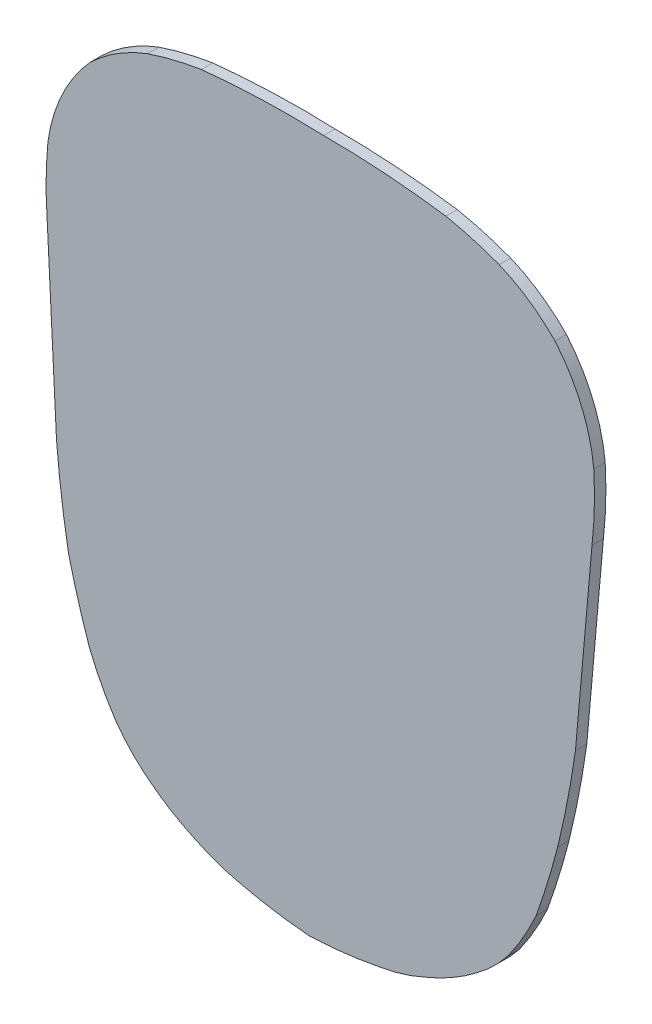
ISO-10303-21;
HEADER;
FILE_DESCRIPTION(('STEP AP214'),'2;1');
FILE_NAME('part.step','',(''),(''),'','','');
FILE_SCHEMA(('AUTOMOTIVE_DESIGN { 1 0 10303 214 1 1 1 1 }'));
ENDSEC;
DATA;
#1=APPLICATION_CONTEXT('core data for automotive mechanical design processes');
#2=APPLICATION_PROTOCOL_DEFINITION('international standard','automotive_design',2000,#1);
#3=PRODUCT_CONTEXT('',#1,'mechanical');
#4=PRODUCT('Part','Part','',(#3));
#5=PRODUCT_RELATED_PRODUCT_CATEGORY('part','',(#4));
#6=PRODUCT_DEFINITION_FORMATION('','',#4);
#7=PRODUCT_DEFINITION_CONTEXT('part definition',#1,'design');
#8=PRODUCT_DEFINITION('design','',#6,#7);
#9=PRODUCT_DEFINITION_SHAPE('','',#8);
#10=(LENGTH_UNIT() NAMED_UNIT(*) SI_UNIT(.MILLI.,.METRE.));
#11=(NAMED_UNIT(*) PLANE_ANGLE_UNIT() SI_UNIT($,.RADIAN.));
#12=(NAMED_UNIT(*) SI_UNIT($,.STERADIAN.) SOLID_ANGLE_UNIT());
#13=UNCERTAINTY_MEASURE_WITH_UNIT(LENGTH_MEASURE(1.E-05),#10,'distance_accuracy_value','');
#14=(GEOMETRIC_REPRESENTATION_CONTEXT(3) GLOBAL_UNCERTAINTY_ASSIGNED_CONTEXT((#13)) GLOBAL_UNIT_ASSIGNED_CONTEXT((#10,
#11,#12)) REPRESENTATION_CONTEXT('',''));
#15=CARTESIAN_POINT('',(0.,0.,0.));
#16=DIRECTION('',(0.,0.,1.));
#17=DIRECTION('',(1.,0.,0.));
#18=AXIS2_PLACEMENT_3D('',#15,#16,#17);
#19=CARTESIAN_POINT('',(-2.87645068487024,-22.2307778413904,40.6500965279302));
#20=DIRECTION('',(0.,0.,1.));
#21=DIRECTION('',(0.0193548335692301,0.999812677663925,0.));
#22=AXIS2_PLACEMENT_3D('',#19,#20,#21);
#23=PLANE('',#22);
#24=CARTESIAN_POINT('',(3.40605421210535,8.02001484887186,40.65009652793));
#25=DIRECTION('',(0.,0.,-1.));
#26=DIRECTION('',(-0.0193548335692301,-0.999812677663925,0.));
#27=AXIS2_PLACEMENT_3D('',#24,#25,#26);
#28=CIRCLE('',#27,7.43643173112);
#29=CARTESIAN_POINT('',(8.74976189327235,13.1916011731872,40.6500965279301));
#30=VERTEX_POINT('',#29);
#31=CARTESIAN_POINT('',(6.29473617833661,14.8724621043842,40.6500965279299));
#32=VERTEX_POINT('',#31);
#33=EDGE_CURVE('E362',#30,#32,#28,.F.);
#34=ORIENTED_EDGE('',*,*,#33,.F.);
#35=CARTESIAN_POINT('',(3.11803650286184,8.4313045354857,40.6500965279299));
#36=DIRECTION('',(0.,0.,-1.));
#37=DIRECTION('',(-0.0193548335692301,-0.999812677663925,0.));
#38=AXIS2_PLACEMENT_3D('',#35,#36,#37);
#39=CIRCLE('',#38,7.3740595978);
#40=CARTESIAN_POINT('',(10.4553019723893,9.16702892789537,40.6500965279302));
#41=VERTEX_POINT('',#40);
#42=EDGE_CURVE('E208',#41,#30,#39,.F.);
#43=ORIENTED_EDGE('',*,*,#42,.F.);
#44=CARTESIAN_POINT('',(-6.32552371849103,8.14421174061839,40.6500965279296));
#45=DIRECTION('',(0.,0.,-1.));
#46=DIRECTION('',(-0.0193548335692301,-0.999812677663925,0.));
#47=AXIS2_PLACEMENT_3D('',#44,#45,#46);
#48=CIRCLE('',#47,16.81196793556);
#49=CARTESIAN_POINT('',(10.3766044314372,6.22557130278915,40.6500965279302));
#50=VERTEX_POINT('',#49);
#51=EDGE_CURVE('E35',#50,#41,#48,.F.);
#52=ORIENTED_EDGE('',*,*,#51,.F.);
#53=DIRECTION('',(-0.0886995040357044,-0.996058431008854,0.));
#54=VECTOR('',#53,1.);
#55=CARTESIAN_POINT('',(10.3766044314372,6.22557130278917,40.6500965279302));
#56=LINE('',#55,#54);
#57=CARTESIAN_POINT('',(9.64811099468473,-1.9551061147509,40.6500965279303));
#58=VERTEX_POINT('',#57);
#59=EDGE_CURVE('E207',#50,#58,#56,.T.);
#60=ORIENTED_EDGE('',*,*,#59,.T.);
#61=CARTESIAN_POINT('',(-31.2814474166912,3.8013435473197,40.6500965279289));
#62=DIRECTION('',(0.,0.,-1.));
#63=DIRECTION('',(-0.0193548335692301,-0.999812677663925,0.));
#64=AXIS2_PLACEMENT_3D('',#61,#62,#63);
#65=CIRCLE('',#64,41.33237791928);
#66=CARTESIAN_POINT('',(8.86403234955439,-6.03257321052164,40.6500965279303));
#67=VERTEX_POINT('',#66);
#68=EDGE_CURVE('E218',#67,#58,#65,.F.);
#69=ORIENTED_EDGE('',*,*,#68,.F.);
#70=CARTESIAN_POINT('',(-24.9737606237931,2.68335405814092,40.6500965279291));
#71=DIRECTION('',(0.,0.,-1.));
#72=DIRECTION('',(-0.0193548335692301,-0.999812677663925,0.));
#73=AXIS2_PLACEMENT_3D('',#70,#71,#72);
#74=CIRCLE('',#73,34.94228987144);
#75=CARTESIAN_POINT('',(7.91947678147978,-9.10641075970414,40.6500965279303));
#76=VERTEX_POINT('',#75);
#77=EDGE_CURVE('E302',#76,#67,#74,.F.);
#78=ORIENTED_EDGE('',*,*,#77,.F.);
#79=CARTESIAN_POINT('',(-3.58067037627307,-3.93497982202901,40.6500965279299));
#80=DIRECTION('',(0.,0.,-1.));
#81=DIRECTION('',(-0.0193548335692301,-0.999812677663925,0.));
#82=AXIS2_PLACEMENT_3D('',#79,#80,#81);
#83=CIRCLE('',#82,12.60940452968);
#84=CARTESIAN_POINT('',(6.69776683055141,-11.2391437836663,40.6500965279303));
#85=VERTEX_POINT('',#84);
#86=EDGE_CURVE('E305',#85,#76,#83,.F.);
#87=ORIENTED_EDGE('',*,*,#86,.F.);
#88=CARTESIAN_POINT('',(1.10266886694135,-6.86934474010805,40.6500965279301));
#89=DIRECTION('',(0.,0.,-1.));
#90=DIRECTION('',(-0.0193548335692301,-0.999812677663925,0.));
#91=AXIS2_PLACEMENT_3D('',#88,#89,#90);
#92=CIRCLE('',#91,7.09931439672);
#93=CARTESIAN_POINT('',(5.30083998115858,-12.5943446701716,40.6500965279303));
#94=VERTEX_POINT('',#93);
#95=EDGE_CURVE('E308',#94,#85,#92,.F.);
#96=ORIENTED_EDGE('',*,*,#95,.F.);
#97=CARTESIAN_POINT('',(-0.638723059391889,-4.83953730632285,40.65009652793));
#98=DIRECTION('',(0.,0.,-1.));
#99=DIRECTION('',(-0.0193548335692301,-0.999812677663925,0.));
#100=AXIS2_PLACEMENT_3D('',#97,#98,#99);
#101=CIRCLE('',#100,9.76808304444);
#102=CARTESIAN_POINT('',(3.02325465351674,-13.8952187049387,40.6500965279303));
#103=VERTEX_POINT('',#102);
#104=EDGE_CURVE('E311',#103,#94,#101,.F.);
#105=ORIENTED_EDGE('',*,*,#104,.F.);
#106=CARTESIAN_POINT('',(-0.207770559998184,-6.83732878190935,40.6500965279301));
#107=DIRECTION('',(0.,0.,-1.));
#108=DIRECTION('',(-0.0193548335692301,-0.999812677663925,0.));
#109=AXIS2_PLACEMENT_3D('',#106,#107,#108);
#110=CIRCLE('',#109,7.76230211316);
#111=CARTESIAN_POINT('',(1.11765382111102,-14.4856347581324,40.6500965279302));
#112=VERTEX_POINT('',#111);
#113=EDGE_CURVE('E314',#112,#103,#110,.F.);
#114=ORIENTED_EDGE('',*,*,#113,.F.);
#115=CARTESIAN_POINT('',(-2.80966912930594,4.7550090968341,40.6500965279298));
#116=DIRECTION('',(0.,0.,-1.));
#117=DIRECTION('',(-0.0193548335692301,-0.999812677663925,0.));
#118=AXIS2_PLACEMENT_3D('',#115,#116,#117);
#119=CIRCLE('',#118,19.6373684976);
#120=CARTESIAN_POINT('',(-2.01526832310912,-14.8662846645275,40.6500965279301));
#121=VERTEX_POINT('',#120);
#122=EDGE_CURVE('E317',#121,#112,#119,.F.);
#123=ORIENTED_EDGE('',*,*,#122,.F.);
#124=CARTESIAN_POINT('',(-0.523207579480618,4.71400533480678,40.6500965279299));
#125=DIRECTION('',(0.,0.,-1.));
#126=DIRECTION('',(-0.0193548335692301,-0.999812677663925,0.));
#127=AXIS2_PLACEMENT_3D('',#124,#125,#126);
#128=CIRCLE('',#127,19.63705684976);
#129=CARTESIAN_POINT('',(-5.1763378218956,-14.3637927736708,40.65009652793));
#130=VERTEX_POINT('',#129);
#131=EDGE_CURVE('E320',#130,#121,#128,.F.);
#132=ORIENTED_EDGE('',*,*,#131,.F.);
#133=CARTESIAN_POINT('',(-3.55589855490557,-6.7725141805769,40.6500965279299));
#134=DIRECTION('',(0.,0.,-1.));
#135=DIRECTION('',(-0.0193548335692301,-0.999812677663925,0.));
#136=AXIS2_PLACEMENT_3D('',#133,#134,#135);
#137=CIRCLE('',#136,7.76230211316);
#138=CARTESIAN_POINT('',(-7.05766041396085,-13.7000677154429,40.6500965279299));
#139=VERTEX_POINT('',#138);
#140=EDGE_CURVE('E323',#139,#130,#137,.F.);
#141=ORIENTED_EDGE('',*,*,#140,.F.);
#142=CARTESIAN_POINT('',(-3.04794957670775,-4.79289839153915,40.6500965279299));
#143=DIRECTION('',(0.,0.,-1.));
#144=DIRECTION('',(-0.0193548335692301,-0.999812677663925,0.));
#145=AXIS2_PLACEMENT_3D('',#142,#143,#144);
#146=CIRCLE('',#145,9.76808304444);
#147=CARTESIAN_POINT('',(-9.28319236302833,-12.3120202657152,40.6500965279298));
#148=VERTEX_POINT('',#147);
#149=EDGE_CURVE('E326',#148,#139,#146,.F.);
#150=ORIENTED_EDGE('',*,*,#149,.F.);
#151=CARTESIAN_POINT('',(-4.76167465689594,-6.8387997753086,40.6500965279299));
#152=DIRECTION('',(0.,0.,-1.));
#153=DIRECTION('',(-0.0193548335692301,-0.999812677663925,0.));
#154=AXIS2_PLACEMENT_3D('',#151,#152,#153);
#155=CIRCLE('',#154,7.09931439672);
#156=CARTESIAN_POINT('',(-10.5813963887554,-10.9046457963967,40.6500965279298));
#157=VERTEX_POINT('',#156);
#158=EDGE_CURVE('E329',#157,#148,#155,.F.);
#159=ORIENTED_EDGE('',*,*,#158,.F.);
#160=CARTESIAN_POINT('',(-0.0279711922389195,-4.00375460651083,40.65009652793));
#161=DIRECTION('',(0.,0.,-1.));
#162=DIRECTION('',(-0.0193548335692301,-0.999812677663925,0.));
#163=AXIS2_PLACEMENT_3D('',#160,#161,#162);
#164=CIRCLE('',#163,12.60940452968);
#165=CARTESIAN_POINT('',(-11.719649090564,-8.72622753019504,40.6500965279297));
#166=VERTEX_POINT('',#165);
#167=EDGE_CURVE('E332',#166,#157,#164,.F.);
#168=ORIENTED_EDGE('',*,*,#167,.F.);
#169=CARTESIAN_POINT('',(21.3074102324666,2.68328490166432,40.6500965279306));
#170=DIRECTION('',(0.,0.,-1.));
#171=DIRECTION('',(-0.0193548335692301,-0.999812677663925,0.));
#172=AXIS2_PLACEMENT_3D('',#169,#170,#171);
#173=CIRCLE('',#172,34.94228987144);
#174=CARTESIAN_POINT('',(-12.6348799299237,-5.61638738053111,40.6500965279296));
#175=VERTEX_POINT('',#174);
#176=EDGE_CURVE('E335',#175,#166,#173,.F.);
#177=ORIENTED_EDGE('',*,*,#176,.F.);
#178=CARTESIAN_POINT('',(28.0310735031443,1.77588533100576,40.6500965279308));
#179=DIRECTION('',(0.,0.,-1.));
#180=DIRECTION('',(-0.0193548335692301,-0.999812677663925,0.));
#181=AXIS2_PLACEMENT_3D('',#178,#179,#180);
#182=CIRCLE('',#181,41.33237791928);
#183=CARTESIAN_POINT('',(-13.1702154109103,-1.51337845938617,40.6500965279295));
#184=VERTEX_POINT('',#183);
#185=EDGE_CURVE('E338',#184,#175,#182,.F.);
#186=ORIENTED_EDGE('',*,*,#185,.F.);
#187=DIRECTION('',(-0.0500831809567766,0.998745050042928,0.));
#188=VECTOR('',#187,1.);
#189=CARTESIAN_POINT('',(-13.1702154109104,-1.51337845938577,40.6500965279295));
#190=LINE('',#189,#188);
#191=CARTESIAN_POINT('',(-13.581551066226,6.6893642938588,40.6500965279294));
#192=VERTEX_POINT('',#191);
#193=EDGE_CURVE('E226',#184,#192,#190,.T.);
#194=ORIENTED_EDGE('',*,*,#193,.T.);
#195=CARTESIAN_POINT('',(3.18231954948573,7.96015453853931,40.6500965279299));
#196=DIRECTION('',(0.,0.,-1.));
#197=DIRECTION('',(-0.0193548335692301,-0.999812677663925,0.));
#198=AXIS2_PLACEMENT_3D('',#195,#196,#197);
#199=CIRCLE('',#198,16.81196793556);
#200=CARTESIAN_POINT('',(-13.5463481289566,9.63166390750373,40.6500965279294));
#201=VERTEX_POINT('',#200);
#202=EDGE_CURVE('E229',#201,#192,#199,.F.);
#203=ORIENTED_EDGE('',*,*,#202,.F.);
#204=CARTESIAN_POINT('',(-6.24305419079949,8.61252083374831,40.6500965279296));
#205=DIRECTION('',(0.,0.,-1.));
#206=DIRECTION('',(-0.0193548335692301,-0.999812677663925,0.));
#207=AXIS2_PLACEMENT_3D('',#204,#205,#206);
#208=CIRCLE('',#207,7.3740595978);
#209=CARTESIAN_POINT('',(-11.6863252040827,13.5872123445716,40.6500965279294));
#210=VERTEX_POINT('',#209);
#211=EDGE_CURVE('E344',#210,#201,#208,.F.);
#212=ORIENTED_EDGE('',*,*,#211,.F.);
#213=CARTESIAN_POINT('',(-6.54677401618397,8.21268627443506,40.6500965279296));
#214=DIRECTION('',(0.,0.,-1.));
#215=DIRECTION('',(-0.0193548335692301,-0.999812677663925,0.));
#216=AXIS2_PLACEMENT_3D('',#213,#214,#215);
#217=CIRCLE('',#216,7.43643173112);
#218=CARTESIAN_POINT('',(-9.16808546254466,15.17179851615,40.6500965279295));
#219=VERTEX_POINT('',#218);
#220=EDGE_CURVE('E347',#219,#210,#217,.F.);
#221=ORIENTED_EDGE('',*,*,#220,.F.);
#222=CARTESIAN_POINT('',(-4.43670572158516,1.02428534892834,40.6500965279298));
#223=DIRECTION('',(0.,0.,-1.));
#224=DIRECTION('',(-0.0193548335692301,-0.999812677663925,0.));
#225=AXIS2_PLACEMENT_3D('',#222,#223,#224);
#226=CIRCLE('',#225,14.91771038296);
#227=CARTESIAN_POINT('',(-6.80003650135277,15.7536013783737,40.6500965279295));
#228=VERTEX_POINT('',#227);
#229=EDGE_CURVE('E350',#228,#219,#226,.F.);
#230=ORIENTED_EDGE('',*,*,#229,.F.);
#231=CARTESIAN_POINT('',(-2.87645068487024,-22.2307778413904,40.6500965279302));
#232=DIRECTION('',(0.,0.,-1.));
#233=DIRECTION('',(-0.0193548335692301,-0.999812677663925,0.));
#234=AXIS2_PLACEMENT_3D('',#231,#232,#233);
#235=CIRCLE('',#234,38.18648439396);
#236=CARTESIAN_POINT('',(-1.41914055333817,15.9278887698879,40.6500965279297));
#237=VERTEX_POINT('',#236);
#238=EDGE_CURVE('E353',#237,#228,#235,.F.);
#239=ORIENTED_EDGE('',*,*,#238,.F.);
#240=CARTESIAN_POINT('',(-1.43975485684213,-22.2585901013477,40.6500965279302));
#241=DIRECTION('',(0.,0.,-1.));
#242=DIRECTION('',(-0.0193548335692301,-0.999812677663925,0.));
#243=AXIS2_PLACEMENT_3D('',#240,#241,#242);
#244=CIRCLE('',#243,38.186484435371);
#245=CARTESIAN_POINT('',(3.95097858118653,15.5454782846468,40.6500965279299));
#246=VERTEX_POINT('',#245);
#247=EDGE_CURVE('E356',#246,#237,#244,.F.);
#248=ORIENTED_EDGE('',*,*,#247,.F.);
#249=CARTESIAN_POINT('',(1.01935833845508,0.91866435193131,40.65009652793));
#250=DIRECTION('',(0.,0.,-1.));
#251=DIRECTION('',(-0.0193548335692301,-0.999812677663925,0.));
#252=AXIS2_PLACEMENT_3D('',#249,#250,#251);
#253=CIRCLE('',#252,14.91771038296);
#254=EDGE_CURVE('E359',#32,#246,#253,.F.);
#255=ORIENTED_EDGE('',*,*,#254,.F.);
#256=EDGE_LOOP('',(#34,#43,#52,#60,#69,#78,#87,#96,#105,#114,#123,#132,#141,#150,#159,#168,#177,
#186,#194,#203,#212,#221,#230,#239,#248,#255));
#257=FACE_BOUND('',#256,.T.);
#258=ADVANCED_FACE('F32',(#257),#23,.F.);
#259=CARTESIAN_POINT('',(-6.32552371849104,8.1442117406184,41.0310965279296));
#260=DIRECTION('',(0.,0.,-1.));
#261=DIRECTION('',(-0.0193548335692301,-0.999812677663925,0.));
#262=AXIS2_PLACEMENT_3D('',#259,#260,#261);
#263=CYLINDRICAL_SURFACE('',#262,16.81196793556);
#264=DIRECTION('',(0.,0.,-1.));
#265=VECTOR('',#264,1.);
#266=CARTESIAN_POINT('',(10.4553019723893,9.16702892789542,41.0310965279302));
#267=LINE('',#266,#265);
#268=CARTESIAN_POINT('',(10.4553019723893,9.1670289278954,41.1510965279302));
#269=VERTEX_POINT('',#268);
#270=EDGE_CURVE('E211',#269,#41,#267,.T.);
#271=ORIENTED_EDGE('',*,*,#270,.F.);
#272=CARTESIAN_POINT('',(-6.32552371849105,8.1442117406184,41.1510965279296));
#273=DIRECTION('',(0.,0.,-1.));
#274=DIRECTION('',(-0.0193548335692301,-0.999812677663925,0.));
#275=AXIS2_PLACEMENT_3D('',#272,#273,#274);
#276=CIRCLE('',#275,16.81196793556);
#277=CARTESIAN_POINT('',(10.3766044314372,6.22557130278928,41.1510965279302));
#278=VERTEX_POINT('',#277);
#279=EDGE_CURVE('E216',#278,#269,#276,.F.);
#280=ORIENTED_EDGE('',*,*,#279,.F.);
#281=DIRECTION('',(0.,0.,1.));
#282=VECTOR('',#281,1.);
#283=CARTESIAN_POINT('',(10.3766044314372,6.22557130278919,41.0310965279302));
#284=LINE('',#283,#282);
#285=EDGE_CURVE('E213',#278,#50,#284,.F.);
#286=ORIENTED_EDGE('',*,*,#285,.T.);
#287=ORIENTED_EDGE('',*,*,#51,.T.);
#288=EDGE_LOOP('',(#271,#280,#286,#287));
#289=FACE_BOUND('',#288,.T.);
#290=ADVANCED_FACE('F214',(#289),#263,.T.);
#291=CARTESIAN_POINT('',(3.11803650286183,8.43130453548571,41.0310965279299));
#292=DIRECTION('',(0.,0.,-1.));
#293=DIRECTION('',(-0.0193548335692301,-0.999812677663925,0.));
#294=AXIS2_PLACEMENT_3D('',#291,#292,#293);
#295=CYLINDRICAL_SURFACE('',#294,7.3740595978);
#296=DIRECTION('',(0.,0.,-1.));
#297=VECTOR('',#296,1.);
#298=CARTESIAN_POINT('',(8.74976189327234,13.1916011731872,41.03109652793));
#299=LINE('',#298,#297);
#300=CARTESIAN_POINT('',(8.74976189327234,13.1916011731872,41.15109652793));
#301=VERTEX_POINT('',#300);
#302=EDGE_CURVE('E363',#301,#30,#299,.T.);
#303=ORIENTED_EDGE('',*,*,#302,.F.);
#304=CARTESIAN_POINT('',(3.11803650286183,8.43130453548571,41.1510965279299));
#305=DIRECTION('',(0.,0.,-1.));
#306=DIRECTION('',(-0.0193548335692301,-0.999812677663925,0.));
#307=AXIS2_PLACEMENT_3D('',#304,#305,#306);
#308=CIRCLE('',#307,7.3740595978);
#309=EDGE_CURVE('E296',#269,#301,#308,.F.);
#310=ORIENTED_EDGE('',*,*,#309,.F.);
#311=ORIENTED_EDGE('',*,*,#270,.T.);
#312=ORIENTED_EDGE('',*,*,#42,.T.);
#313=EDGE_LOOP('',(#303,#310,#311,#312));
#314=FACE_BOUND('',#313,.T.);
#315=ADVANCED_FACE('F367',(#314),#295,.T.);
#316=CARTESIAN_POINT('',(3.40605421210534,8.02001484887187,41.03109652793));
#317=DIRECTION('',(0.,0.,-1.));
#318=DIRECTION('',(-0.0193548335692301,-0.999812677663925,0.));
#319=AXIS2_PLACEMENT_3D('',#316,#317,#318);
#320=CYLINDRICAL_SURFACE('',#319,7.43643173112);
#321=DIRECTION('',(0.,0.,-1.));
#322=VECTOR('',#321,1.);
#323=CARTESIAN_POINT('',(6.2947361783366,14.8724621043842,41.0310965279299));
#324=LINE('',#323,#322);
#325=CARTESIAN_POINT('',(6.29473617833659,14.8724621043842,41.1510965279299));
#326=VERTEX_POINT('',#325);
#327=EDGE_CURVE('E361',#326,#32,#324,.T.);
#328=ORIENTED_EDGE('',*,*,#327,.F.);
#329=CARTESIAN_POINT('',(3.40605421210533,8.02001484887187,41.15109652793));
#330=DIRECTION('',(0.,0.,-1.));
#331=DIRECTION('',(-0.0193548335692301,-0.999812677663925,0.));
#332=AXIS2_PLACEMENT_3D('',#329,#330,#331);
#333=CIRCLE('',#332,7.43643173112);
#334=EDGE_CURVE('E293',#301,#326,#333,.F.);
#335=ORIENTED_EDGE('',*,*,#334,.F.);
#336=ORIENTED_EDGE('',*,*,#302,.T.);
#337=ORIENTED_EDGE('',*,*,#33,.T.);
#338=EDGE_LOOP('',(#328,#335,#336,#337));
#339=FACE_BOUND('',#338,.T.);
#340=ADVANCED_FACE('F423',(#339),#320,.T.);
#341=CARTESIAN_POINT('',(1.01935833845507,0.918664351931317,41.03109652793));
#342=DIRECTION('',(0.,0.,-1.));
#343=DIRECTION('',(-0.0193548335692301,-0.999812677663925,0.));
#344=AXIS2_PLACEMENT_3D('',#341,#342,#343);
#345=CYLINDRICAL_SURFACE('',#344,14.91771038296);
#346=DIRECTION('',(0.,0.,-1.));
#347=VECTOR('',#346,1.);
#348=CARTESIAN_POINT('',(3.95097858118655,15.5454782846468,41.0310965279299));
#349=LINE('',#348,#347);
#350=CARTESIAN_POINT('',(3.95097858118653,15.5454782846468,41.1510965279299));
#351=VERTEX_POINT('',#350);
#352=EDGE_CURVE('E358',#351,#246,#349,.T.);
#353=ORIENTED_EDGE('',*,*,#352,.F.);
#354=CARTESIAN_POINT('',(1.01935833845506,0.918664351931319,41.15109652793));
#355=DIRECTION('',(0.,0.,-1.));
#356=DIRECTION('',(-0.0193548335692301,-0.999812677663925,0.));
#357=AXIS2_PLACEMENT_3D('',#354,#355,#356);
#358=CIRCLE('',#357,14.91771038296);
#359=EDGE_CURVE('E290',#326,#351,#358,.F.);
#360=ORIENTED_EDGE('',*,*,#359,.F.);
#361=ORIENTED_EDGE('',*,*,#327,.T.);
#362=ORIENTED_EDGE('',*,*,#254,.T.);
#363=EDGE_LOOP('',(#353,#360,#361,#362));
#364=FACE_BOUND('',#363,.T.);
#365=ADVANCED_FACE('F419',(#364),#345,.T.);
#366=CARTESIAN_POINT('',(-1.43975485684214,-22.2585901013477,41.0310965279302));
#367=DIRECTION('',(0.,0.,-1.));
#368=DIRECTION('',(-0.0193548335692301,-0.999812677663925,0.));
#369=AXIS2_PLACEMENT_3D('',#366,#367,#368);
#370=CYLINDRICAL_SURFACE('',#369,38.186484435371);
#371=DIRECTION('',(0.,0.,-1.));
#372=VECTOR('',#371,1.);
#373=CARTESIAN_POINT('',(-1.41914055333808,15.9278887698879,41.0310965279297));
#374=LINE('',#373,#372);
#375=CARTESIAN_POINT('',(-1.41914055333819,15.9278887698879,41.1510965279297));
#376=VERTEX_POINT('',#375);
#377=EDGE_CURVE('E355',#376,#237,#374,.T.);
#378=ORIENTED_EDGE('',*,*,#377,.F.);
#379=CARTESIAN_POINT('',(-1.43975485684214,-22.2585901013477,41.1510965279302));
#380=DIRECTION('',(0.,0.,-1.));
#381=DIRECTION('',(-0.0193548335692301,-0.999812677663925,0.));
#382=AXIS2_PLACEMENT_3D('',#379,#380,#381);
#383=CIRCLE('',#382,38.186484435371);
#384=EDGE_CURVE('E287',#351,#376,#383,.F.);
#385=ORIENTED_EDGE('',*,*,#384,.F.);
#386=ORIENTED_EDGE('',*,*,#352,.T.);
#387=ORIENTED_EDGE('',*,*,#247,.T.);
#388=EDGE_LOOP('',(#378,#385,#386,#387));
#389=FACE_BOUND('',#388,.T.);
#390=ADVANCED_FACE('F428',(#389),#370,.T.);
#391=CARTESIAN_POINT('',(-2.87645068487026,-22.2307778413904,41.0310965279302));
#392=DIRECTION('',(0.,0.,-1.));
#393=DIRECTION('',(-0.0193548335692301,-0.999812677663925,0.));
#394=AXIS2_PLACEMENT_3D('',#391,#392,#393);
#395=CYLINDRICAL_SURFACE('',#394,38.18648439396);
#396=DIRECTION('',(0.,0.,-1.));
#397=VECTOR('',#396,1.);
#398=CARTESIAN_POINT('',(-6.80003650135279,15.7536013783737,41.0310965279295));
#399=LINE('',#398,#397);
#400=CARTESIAN_POINT('',(-6.80003650135281,15.7536013783737,41.1510965279295));
#401=VERTEX_POINT('',#400);
#402=EDGE_CURVE('E352',#401,#228,#399,.T.);
#403=ORIENTED_EDGE('',*,*,#402,.F.);
#404=CARTESIAN_POINT('',(-2.87645068487026,-22.2307778413904,41.1510965279302));
#405=DIRECTION('',(0.,0.,-1.));
#406=DIRECTION('',(-0.0193548335692301,-0.999812677663925,0.));
#407=AXIS2_PLACEMENT_3D('',#404,#405,#406);
#408=CIRCLE('',#407,38.18648439396);
#409=EDGE_CURVE('E284',#376,#401,#408,.F.);
#410=ORIENTED_EDGE('',*,*,#409,.F.);
#411=ORIENTED_EDGE('',*,*,#377,.T.);
#412=ORIENTED_EDGE('',*,*,#238,.T.);
#413=EDGE_LOOP('',(#403,#410,#411,#412));
#414=FACE_BOUND('',#413,.T.);
#415=ADVANCED_FACE('F432',(#414),#395,.T.);
#416=CARTESIAN_POINT('',(-4.43670572158517,1.02428534892834,41.0310965279298));
#417=DIRECTION('',(0.,0.,-1.));
#418=DIRECTION('',(-0.0193548335692301,-0.999812677663925,0.));
#419=AXIS2_PLACEMENT_3D('',#416,#417,#418);
#420=CYLINDRICAL_SURFACE('',#419,14.91771038296);
#421=DIRECTION('',(0.,0.,-1.));
#422=VECTOR('',#421,1.);
#423=CARTESIAN_POINT('',(-9.16808546254464,15.17179851615,41.0310965279295));
#424=LINE('',#423,#422);
#425=CARTESIAN_POINT('',(-9.16808546254467,15.17179851615,41.1510965279294));
#426=VERTEX_POINT('',#425);
#427=EDGE_CURVE('E349',#426,#219,#424,.T.);
#428=ORIENTED_EDGE('',*,*,#427,.F.);
#429=CARTESIAN_POINT('',(-4.43670572158517,1.02428534892834,41.1510965279298));
#430=DIRECTION('',(0.,0.,-1.));
#431=DIRECTION('',(-0.0193548335692301,-0.999812677663925,0.));
#432=AXIS2_PLACEMENT_3D('',#429,#430,#431);
#433=CIRCLE('',#432,14.91771038296);
#434=EDGE_CURVE('E281',#401,#426,#433,.F.);
#435=ORIENTED_EDGE('',*,*,#434,.F.);
#436=ORIENTED_EDGE('',*,*,#402,.T.);
#437=ORIENTED_EDGE('',*,*,#229,.T.);
#438=EDGE_LOOP('',(#428,#435,#436,#437));
#439=FACE_BOUND('',#438,.T.);
#440=ADVANCED_FACE('F434',(#439),#420,.T.);
#441=CARTESIAN_POINT('',(-6.54677401618398,8.21268627443507,41.0310965279296));
#442=DIRECTION('',(0.,0.,-1.));
#443=DIRECTION('',(-0.0193548335692301,-0.999812677663925,0.));
#444=AXIS2_PLACEMENT_3D('',#441,#442,#443);
#445=CYLINDRICAL_SURFACE('',#444,7.43643173112);
#446=DIRECTION('',(0.,0.,-1.));
#447=VECTOR('',#446,1.);
#448=CARTESIAN_POINT('',(-11.6863252040827,13.5872123445716,41.0310965279294));
#449=LINE('',#448,#447);
#450=CARTESIAN_POINT('',(-11.6863252040827,13.5872123445716,41.1510965279294));
#451=VERTEX_POINT('',#450);
#452=EDGE_CURVE('E346',#451,#210,#449,.T.);
#453=ORIENTED_EDGE('',*,*,#452,.F.);
#454=CARTESIAN_POINT('',(-6.54677401618398,8.21268627443507,41.1510965279296));
#455=DIRECTION('',(0.,0.,-1.));
#456=DIRECTION('',(-0.0193548335692301,-0.999812677663925,0.));
#457=AXIS2_PLACEMENT_3D('',#454,#455,#456);
#458=CIRCLE('',#457,7.43643173112);
#459=EDGE_CURVE('E278',#426,#451,#458,.F.);
#460=ORIENTED_EDGE('',*,*,#459,.F.);
#461=ORIENTED_EDGE('',*,*,#427,.T.);
#462=ORIENTED_EDGE('',*,*,#220,.T.);
#463=EDGE_LOOP('',(#453,#460,#461,#462));
#464=FACE_BOUND('',#463,.T.);
#465=ADVANCED_FACE('F438',(#464),#445,.T.);
#466=CARTESIAN_POINT('',(-6.24305419079951,8.61252083374832,41.0310965279296));
#467=DIRECTION('',(0.,0.,-1.));
#468=DIRECTION('',(-0.0193548335692301,-0.999812677663925,0.));
#469=AXIS2_PLACEMENT_3D('',#466,#467,#468);
#470=CYLINDRICAL_SURFACE('',#469,7.3740595978);
#471=DIRECTION('',(0.,0.,-1.));
#472=VECTOR('',#471,1.);
#473=CARTESIAN_POINT('',(-13.5463481289566,9.63166390750374,41.0310965279294));
#474=LINE('',#473,#472);
#475=CARTESIAN_POINT('',(-13.5463481289566,9.63166390750374,41.1510965279294));
#476=VERTEX_POINT('',#475);
#477=EDGE_CURVE('E343',#476,#201,#474,.T.);
#478=ORIENTED_EDGE('',*,*,#477,.F.);
#479=CARTESIAN_POINT('',(-6.24305419079951,8.61252083374832,41.1510965279296));
#480=DIRECTION('',(0.,0.,-1.));
#481=DIRECTION('',(-0.0193548335692301,-0.999812677663925,0.));
#482=AXIS2_PLACEMENT_3D('',#479,#480,#481);
#483=CIRCLE('',#482,7.3740595978);
#484=EDGE_CURVE('E275',#451,#476,#483,.F.);
#485=ORIENTED_EDGE('',*,*,#484,.F.);
#486=ORIENTED_EDGE('',*,*,#452,.T.);
#487=ORIENTED_EDGE('',*,*,#211,.T.);
#488=EDGE_LOOP('',(#478,#485,#486,#487));
#489=FACE_BOUND('',#488,.T.);
#490=ADVANCED_FACE('F443',(#489),#470,.T.);
#491=CARTESIAN_POINT('',(3.18231954948572,7.96015453853931,41.0310965279299));
#492=DIRECTION('',(0.,0.,-1.));
#493=DIRECTION('',(-0.0193548335692301,-0.999812677663925,0.));
#494=AXIS2_PLACEMENT_3D('',#491,#492,#493);
#495=CYLINDRICAL_SURFACE('',#494,16.81196793556);
#496=DIRECTION('',(0.,0.,1.));
#497=VECTOR('',#496,1.);
#498=CARTESIAN_POINT('',(-13.581551066226,6.68936429385883,41.0310965279294));
#499=LINE('',#498,#497);
#500=CARTESIAN_POINT('',(-13.581551066226,6.68936429385881,41.1510965279294));
#501=VERTEX_POINT('',#500);
#502=EDGE_CURVE('E228',#192,#501,#499,.T.);
#503=ORIENTED_EDGE('',*,*,#502,.T.);
#504=CARTESIAN_POINT('',(3.18231954948571,7.96015453853931,41.1510965279299));
#505=DIRECTION('',(0.,0.,-1.));
#506=DIRECTION('',(-0.0193548335692301,-0.999812677663925,0.));
#507=AXIS2_PLACEMENT_3D('',#504,#505,#506);
#508=CIRCLE('',#507,16.81196793556);
#509=EDGE_CURVE('E272',#476,#501,#508,.F.);
#510=ORIENTED_EDGE('',*,*,#509,.F.);
#511=ORIENTED_EDGE('',*,*,#477,.T.);
#512=ORIENTED_EDGE('',*,*,#202,.T.);
#513=EDGE_LOOP('',(#503,#510,#511,#512));
#514=FACE_BOUND('',#513,.T.);
#515=ADVANCED_FACE('F447',(#514),#495,.T.);
#516=CARTESIAN_POINT('',(-13.1702154109104,-1.51337845938577,41.0310965279295));
#517=DIRECTION('',(0.998745050042928,0.0500831809567766,0.));
#518=DIRECTION('',(-0.0500831809567766,0.998745050042928,0.));
#519=AXIS2_PLACEMENT_3D('',#516,#517,#518);
#520=PLANE('',#519);
#521=ORIENTED_EDGE('',*,*,#502,.F.);
#522=ORIENTED_EDGE('',*,*,#193,.F.);
#523=DIRECTION('',(0.,0.,-1.));
#524=VECTOR('',#523,1.);
#525=CARTESIAN_POINT('',(-13.1702154109104,-1.51337845938598,41.0310965279295));
#526=LINE('',#525,#524);
#527=CARTESIAN_POINT('',(-13.1702154109104,-1.51337845938603,41.1510965279295));
#528=VERTEX_POINT('',#527);
#529=EDGE_CURVE('E340',#528,#184,#526,.T.);
#530=ORIENTED_EDGE('',*,*,#529,.F.);
#531=DIRECTION('',(0.050083180956776,-0.998745050042928,0.));
#532=VECTOR('',#531,1.);
#533=CARTESIAN_POINT('',(-13.581551066226,6.68936429385877,41.1510965279294));
#534=LINE('',#533,#532);
#535=EDGE_CURVE('E271',#501,#528,#534,.T.);
#536=ORIENTED_EDGE('',*,*,#535,.F.);
#537=EDGE_LOOP('',(#521,#522,#530,#536));
#538=FACE_BOUND('',#537,.T.);
#539=ADVANCED_FACE('F451',(#538),#520,.F.);
#540=CARTESIAN_POINT('',(28.0310735031443,1.77588533100576,41.0310965279308));
#541=DIRECTION('',(0.,0.,-1.));
#542=DIRECTION('',(-0.0193548335692301,-0.999812677663925,0.));
#543=AXIS2_PLACEMENT_3D('',#540,#541,#542);
#544=CYLINDRICAL_SURFACE('',#543,41.33237791928);
#545=DIRECTION('',(0.,0.,-1.));
#546=VECTOR('',#545,1.);
#547=CARTESIAN_POINT('',(-12.6348799299237,-5.61638738053119,41.0310965279296));
#548=LINE('',#547,#546);
#549=CARTESIAN_POINT('',(-12.6348799299237,-5.6163873805311,41.1510965279296));
#550=VERTEX_POINT('',#549);
#551=EDGE_CURVE('E337',#550,#175,#548,.T.);
#552=ORIENTED_EDGE('',*,*,#551,.F.);
#553=CARTESIAN_POINT('',(28.0310735031443,1.77588533100576,41.1510965279308));
#554=DIRECTION('',(0.,0.,-1.));
#555=DIRECTION('',(-0.0193548335692301,-0.999812677663925,0.));
#556=AXIS2_PLACEMENT_3D('',#553,#554,#555);
#557=CIRCLE('',#556,41.33237791928);
#558=EDGE_CURVE('E268',#528,#550,#557,.F.);
#559=ORIENTED_EDGE('',*,*,#558,.F.);
#560=ORIENTED_EDGE('',*,*,#529,.T.);
#561=ORIENTED_EDGE('',*,*,#185,.T.);
#562=EDGE_LOOP('',(#552,#559,#560,#561));
#563=FACE_BOUND('',#562,.T.);
#564=ADVANCED_FACE('F456',(#563),#544,.T.);
#565=CARTESIAN_POINT('',(21.3074102324666,2.68328490166432,41.0310965279306));
#566=DIRECTION('',(0.,0.,-1.));
#567=DIRECTION('',(-0.0193548335692301,-0.999812677663925,0.));
#568=AXIS2_PLACEMENT_3D('',#565,#566,#567);
#569=CYLINDRICAL_SURFACE('',#568,34.94228987144);
#570=DIRECTION('',(0.,0.,-1.));
#571=VECTOR('',#570,1.);
#572=CARTESIAN_POINT('',(-11.7196490905641,-8.72622753019499,41.0310965279297));
#573=LINE('',#572,#571);
#574=CARTESIAN_POINT('',(-11.7196490905641,-8.726227530195,41.1510965279297));
#575=VERTEX_POINT('',#574);
#576=EDGE_CURVE('E334',#575,#166,#573,.T.);
#577=ORIENTED_EDGE('',*,*,#576,.F.);
#578=CARTESIAN_POINT('',(21.3074102324666,2.68328490166432,41.1510965279305));
#579=DIRECTION('',(0.,0.,-1.));
#580=DIRECTION('',(-0.0193548335692301,-0.999812677663925,0.));
#581=AXIS2_PLACEMENT_3D('',#578,#579,#580);
#582=CIRCLE('',#581,34.94228987144);
#583=EDGE_CURVE('E265',#550,#575,#582,.F.);
#584=ORIENTED_EDGE('',*,*,#583,.F.);
#585=ORIENTED_EDGE('',*,*,#551,.T.);
#586=ORIENTED_EDGE('',*,*,#176,.T.);
#587=EDGE_LOOP('',(#577,#584,#585,#586));
#588=FACE_BOUND('',#587,.T.);
#589=ADVANCED_FACE('F460',(#588),#569,.T.);
#590=CARTESIAN_POINT('',(-0.0279711922389317,-4.00375460651083,41.03109652793));
#591=DIRECTION('',(0.,0.,-1.));
#592=DIRECTION('',(-0.0193548335692301,-0.999812677663925,0.));
#593=AXIS2_PLACEMENT_3D('',#590,#591,#592);
#594=CYLINDRICAL_SURFACE('',#593,12.60940452968);
#595=DIRECTION('',(0.,0.,-1.));
#596=VECTOR('',#595,1.);
#597=CARTESIAN_POINT('',(-10.5813963887555,-10.9046457963967,41.0310965279298));
#598=LINE('',#597,#596);
#599=CARTESIAN_POINT('',(-10.5813963887554,-10.9046457963967,41.1510965279297));
#600=VERTEX_POINT('',#599);
#601=EDGE_CURVE('E331',#600,#157,#598,.T.);
#602=ORIENTED_EDGE('',*,*,#601,.F.);
#603=CARTESIAN_POINT('',(-0.0279711922389356,-4.00375460651083,41.15109652793));
#604=DIRECTION('',(0.,0.,-1.));
#605=DIRECTION('',(-0.0193548335692301,-0.999812677663925,0.));
#606=AXIS2_PLACEMENT_3D('',#603,#604,#605);
#607=CIRCLE('',#606,12.60940452968);
#608=EDGE_CURVE('E262',#575,#600,#607,.F.);
#609=ORIENTED_EDGE('',*,*,#608,.F.);
#610=ORIENTED_EDGE('',*,*,#576,.T.);
#611=ORIENTED_EDGE('',*,*,#167,.T.);
#612=EDGE_LOOP('',(#602,#609,#610,#611));
#613=FACE_BOUND('',#612,.T.);
#614=ADVANCED_FACE('F464',(#613),#594,.T.);
#615=CARTESIAN_POINT('',(-4.76167465689596,-6.83879977530859,41.0310965279299));
#616=DIRECTION('',(0.,0.,-1.));
#617=DIRECTION('',(-0.0193548335692301,-0.999812677663925,0.));
#618=AXIS2_PLACEMENT_3D('',#615,#616,#617);
#619=CYLINDRICAL_SURFACE('',#618,7.09931439672);
#620=DIRECTION('',(0.,0.,-1.));
#621=VECTOR('',#620,1.);
#622=CARTESIAN_POINT('',(-9.28319236302901,-12.3120202657147,41.0310965279298));
#623=LINE('',#622,#621);
#624=CARTESIAN_POINT('',(-9.28319236302829,-12.3120202657153,41.1510965279298));
#625=VERTEX_POINT('',#624);
#626=EDGE_CURVE('E328',#625,#148,#623,.T.);
#627=ORIENTED_EDGE('',*,*,#626,.F.);
#628=CARTESIAN_POINT('',(-4.76167465689596,-6.83879977530859,41.1510965279299));
#629=DIRECTION('',(0.,0.,-1.));
#630=DIRECTION('',(-0.0193548335692301,-0.999812677663925,0.));
#631=AXIS2_PLACEMENT_3D('',#628,#629,#630);
#632=CIRCLE('',#631,7.09931439672);
#633=EDGE_CURVE('E259',#600,#625,#632,.F.);
#634=ORIENTED_EDGE('',*,*,#633,.F.);
#635=ORIENTED_EDGE('',*,*,#601,.T.);
#636=ORIENTED_EDGE('',*,*,#158,.T.);
#637=EDGE_LOOP('',(#627,#634,#635,#636));
#638=FACE_BOUND('',#637,.T.);
#639=ADVANCED_FACE('F468',(#638),#619,.T.);
#640=CARTESIAN_POINT('',(-3.04794957670776,-4.79289839153915,41.0310965279299));
#641=DIRECTION('',(0.,0.,-1.));
#642=DIRECTION('',(-0.0193548335692301,-0.999812677663925,0.));
#643=AXIS2_PLACEMENT_3D('',#640,#641,#642);
#644=CYLINDRICAL_SURFACE('',#643,9.76808304444);
#645=DIRECTION('',(0.,0.,-1.));
#646=VECTOR('',#645,1.);
#647=CARTESIAN_POINT('',(-7.05766041396086,-13.7000677154429,41.0310965279299));
#648=LINE('',#647,#646);
#649=CARTESIAN_POINT('',(-7.05766041396087,-13.7000677154429,41.1510965279299));
#650=VERTEX_POINT('',#649);
#651=EDGE_CURVE('E325',#650,#139,#648,.T.);
#652=ORIENTED_EDGE('',*,*,#651,.F.);
#653=CARTESIAN_POINT('',(-3.04794957670776,-4.79289839153915,41.1510965279299));
#654=DIRECTION('',(0.,0.,-1.));
#655=DIRECTION('',(-0.0193548335692301,-0.999812677663925,0.));
#656=AXIS2_PLACEMENT_3D('',#653,#654,#655);
#657=CIRCLE('',#656,9.76808304444);
#658=EDGE_CURVE('E256',#625,#650,#657,.F.);
#659=ORIENTED_EDGE('',*,*,#658,.F.);
#660=ORIENTED_EDGE('',*,*,#626,.T.);
#661=ORIENTED_EDGE('',*,*,#149,.T.);
#662=EDGE_LOOP('',(#652,#659,#660,#661));
#663=FACE_BOUND('',#662,.T.);
#664=ADVANCED_FACE('F472',(#663),#644,.T.);
#665=CARTESIAN_POINT('',(-3.55589855490558,-6.77251418057689,41.0310965279299));
#666=DIRECTION('',(0.,0.,-1.));
#667=DIRECTION('',(-0.0193548335692301,-0.999812677663925,0.));
#668=AXIS2_PLACEMENT_3D('',#665,#666,#667);
#669=CYLINDRICAL_SURFACE('',#668,7.76230211316);
#670=DIRECTION('',(0.,0.,-1.));
#671=VECTOR('',#670,1.);
#672=CARTESIAN_POINT('',(-5.17633782189558,-14.3637927736708,41.03109652793));
#673=LINE('',#672,#671);
#674=CARTESIAN_POINT('',(-5.17633782189556,-14.3637927736708,41.15109652793));
#675=VERTEX_POINT('',#674);
#676=EDGE_CURVE('E322',#675,#130,#673,.T.);
#677=ORIENTED_EDGE('',*,*,#676,.F.);
#678=CARTESIAN_POINT('',(-3.55589855490558,-6.77251418057689,41.1510965279299));
#679=DIRECTION('',(0.,0.,-1.));
#680=DIRECTION('',(-0.0193548335692301,-0.999812677663925,0.));
#681=AXIS2_PLACEMENT_3D('',#678,#679,#680);
#682=CIRCLE('',#681,7.76230211316);
#683=EDGE_CURVE('E253',#650,#675,#682,.F.);
#684=ORIENTED_EDGE('',*,*,#683,.F.);
#685=ORIENTED_EDGE('',*,*,#651,.T.);
#686=ORIENTED_EDGE('',*,*,#140,.T.);
#687=EDGE_LOOP('',(#677,#684,#685,#686));
#688=FACE_BOUND('',#687,.T.);
#689=ADVANCED_FACE('F476',(#688),#669,.T.);
#690=CARTESIAN_POINT('',(-0.523207579480631,4.71400533480679,41.0310965279299));
#691=DIRECTION('',(0.,0.,-1.));
#692=DIRECTION('',(-0.0193548335692301,-0.999812677663925,0.));
#693=AXIS2_PLACEMENT_3D('',#690,#691,#692);
#694=CYLINDRICAL_SURFACE('',#693,19.63705684976);
#695=DIRECTION('',(0.,0.,-1.));
#696=VECTOR('',#695,1.);
#697=CARTESIAN_POINT('',(-2.01526832310913,-14.8662846645275,41.0310965279301));
#698=LINE('',#697,#696);
#699=CARTESIAN_POINT('',(-2.01526832310914,-14.8662846645275,41.1510965279301));
#700=VERTEX_POINT('',#699);
#701=EDGE_CURVE('E319',#700,#121,#698,.T.);
#702=ORIENTED_EDGE('',*,*,#701,.F.);
#703=CARTESIAN_POINT('',(-0.523207579480634,4.71400533480679,41.1510965279299));
#704=DIRECTION('',(0.,0.,-1.));
#705=DIRECTION('',(-0.0193548335692301,-0.999812677663925,0.));
#706=AXIS2_PLACEMENT_3D('',#703,#704,#705);
#707=CIRCLE('',#706,19.63705684976);
#708=EDGE_CURVE('E250',#675,#700,#707,.F.);
#709=ORIENTED_EDGE('',*,*,#708,.F.);
#710=ORIENTED_EDGE('',*,*,#676,.T.);
#711=ORIENTED_EDGE('',*,*,#131,.T.);
#712=EDGE_LOOP('',(#702,#709,#710,#711));
#713=FACE_BOUND('',#712,.T.);
#714=ADVANCED_FACE('F480',(#713),#694,.T.);
#715=CARTESIAN_POINT('',(-2.80966912930595,4.75500909683411,41.0310965279298));
#716=DIRECTION('',(0.,0.,-1.));
#717=DIRECTION('',(-0.0193548335692301,-0.999812677663925,0.));
#718=AXIS2_PLACEMENT_3D('',#715,#716,#717);
#719=CYLINDRICAL_SURFACE('',#718,19.6373684976);
#720=DIRECTION('',(0.,0.,-1.));
#721=VECTOR('',#720,1.);
#722=CARTESIAN_POINT('',(1.11765382111103,-14.4856347581324,41.0310965279302));
#723=LINE('',#722,#721);
#724=CARTESIAN_POINT('',(1.11765382111102,-14.4856347581324,41.1510965279302));
#725=VERTEX_POINT('',#724);
#726=EDGE_CURVE('E316',#725,#112,#723,.T.);
#727=ORIENTED_EDGE('',*,*,#726,.F.);
#728=CARTESIAN_POINT('',(-2.80966912930596,4.75500909683411,41.1510965279298));
#729=DIRECTION('',(0.,0.,-1.));
#730=DIRECTION('',(-0.0193548335692301,-0.999812677663925,0.));
#731=AXIS2_PLACEMENT_3D('',#728,#729,#730);
#732=CIRCLE('',#731,19.6373684976);
#733=EDGE_CURVE('E247',#700,#725,#732,.F.);
#734=ORIENTED_EDGE('',*,*,#733,.F.);
#735=ORIENTED_EDGE('',*,*,#701,.T.);
#736=ORIENTED_EDGE('',*,*,#122,.T.);
#737=EDGE_LOOP('',(#727,#734,#735,#736));
#738=FACE_BOUND('',#737,.T.);
#739=ADVANCED_FACE('F484',(#738),#719,.T.);
#740=CARTESIAN_POINT('',(-0.207770559998196,-6.83732878190934,41.03109652793));
#741=DIRECTION('',(0.,0.,-1.));
#742=DIRECTION('',(-0.0193548335692301,-0.999812677663925,0.));
#743=AXIS2_PLACEMENT_3D('',#740,#741,#742);
#744=CYLINDRICAL_SURFACE('',#743,7.76230211316);
#745=DIRECTION('',(0.,0.,-1.));
#746=VECTOR('',#745,1.);
#747=CARTESIAN_POINT('',(3.02325465351674,-13.8952187049387,41.0310965279303));
#748=LINE('',#747,#746);
#749=CARTESIAN_POINT('',(3.02325465351673,-13.8952187049387,41.1510965279302));
#750=VERTEX_POINT('',#749);
#751=EDGE_CURVE('E313',#750,#103,#748,.T.);
#752=ORIENTED_EDGE('',*,*,#751,.F.);
#753=CARTESIAN_POINT('',(-0.207770559998199,-6.83732878190934,41.15109652793));
#754=DIRECTION('',(0.,0.,-1.));
#755=DIRECTION('',(-0.0193548335692301,-0.999812677663925,0.));
#756=AXIS2_PLACEMENT_3D('',#753,#754,#755);
#757=CIRCLE('',#756,7.76230211316);
#758=EDGE_CURVE('E244',#725,#750,#757,.F.);
#759=ORIENTED_EDGE('',*,*,#758,.F.);
#760=ORIENTED_EDGE('',*,*,#726,.T.);
#761=ORIENTED_EDGE('',*,*,#113,.T.);
#762=EDGE_LOOP('',(#752,#759,#760,#761));
#763=FACE_BOUND('',#762,.T.);
#764=ADVANCED_FACE('F488',(#763),#744,.T.);
#765=CARTESIAN_POINT('',(-0.638723059391901,-4.83953730632285,41.03109652793));
#766=DIRECTION('',(0.,0.,-1.));
#767=DIRECTION('',(-0.0193548335692301,-0.999812677663925,0.));
#768=AXIS2_PLACEMENT_3D('',#765,#766,#767);
#769=CYLINDRICAL_SURFACE('',#768,9.76808304444);
#770=DIRECTION('',(0.,0.,-1.));
#771=VECTOR('',#770,1.);
#772=CARTESIAN_POINT('',(5.30083998115854,-12.5943446701716,41.0310965279303));
#773=LINE('',#772,#771);
#774=CARTESIAN_POINT('',(5.30083998115857,-12.5943446701716,41.1510965279303));
#775=VERTEX_POINT('',#774);
#776=EDGE_CURVE('E310',#775,#94,#773,.T.);
#777=ORIENTED_EDGE('',*,*,#776,.F.);
#778=CARTESIAN_POINT('',(-0.638723059391905,-4.83953730632285,41.15109652793));
#779=DIRECTION('',(0.,0.,-1.));
#780=DIRECTION('',(-0.0193548335692301,-0.999812677663925,0.));
#781=AXIS2_PLACEMENT_3D('',#778,#779,#780);
#782=CIRCLE('',#781,9.76808304444);
#783=EDGE_CURVE('E241',#750,#775,#782,.F.);
#784=ORIENTED_EDGE('',*,*,#783,.F.);
#785=ORIENTED_EDGE('',*,*,#751,.T.);
#786=ORIENTED_EDGE('',*,*,#104,.T.);
#787=EDGE_LOOP('',(#777,#784,#785,#786));
#788=FACE_BOUND('',#787,.T.);
#789=ADVANCED_FACE('F492',(#788),#769,.T.);
#790=CARTESIAN_POINT('',(1.10266886694134,-6.86934474010805,41.0310965279301));
#791=DIRECTION('',(0.,0.,-1.));
#792=DIRECTION('',(-0.0193548335692301,-0.999812677663925,0.));
#793=AXIS2_PLACEMENT_3D('',#790,#791,#792);
#794=CYLINDRICAL_SURFACE('',#793,7.09931439672);
#795=DIRECTION('',(0.,0.,-1.));
#796=VECTOR('',#795,1.);
#797=CARTESIAN_POINT('',(6.69776683055139,-11.2391437836663,41.0310965279303));
#798=LINE('',#797,#796);
#799=CARTESIAN_POINT('',(6.6977668305514,-11.2391437836663,41.1510965279303));
#800=VERTEX_POINT('',#799);
#801=EDGE_CURVE('E307',#800,#85,#798,.T.);
#802=ORIENTED_EDGE('',*,*,#801,.F.);
#803=CARTESIAN_POINT('',(1.10266886694133,-6.86934474010804,41.15109652793));
#804=DIRECTION('',(0.,0.,-1.));
#805=DIRECTION('',(-0.0193548335692301,-0.999812677663925,0.));
#806=AXIS2_PLACEMENT_3D('',#803,#804,#805);
#807=CIRCLE('',#806,7.09931439672);
#808=EDGE_CURVE('E238',#775,#800,#807,.F.);
#809=ORIENTED_EDGE('',*,*,#808,.F.);
#810=ORIENTED_EDGE('',*,*,#776,.T.);
#811=ORIENTED_EDGE('',*,*,#95,.T.);
#812=EDGE_LOOP('',(#802,#809,#810,#811));
#813=FACE_BOUND('',#812,.T.);
#814=ADVANCED_FACE('F496',(#813),#794,.T.);
#815=CARTESIAN_POINT('',(-3.58067037627309,-3.93497982202901,41.0310965279299));
#816=DIRECTION('',(0.,0.,-1.));
#817=DIRECTION('',(-0.0193548335692301,-0.999812677663925,0.));
#818=AXIS2_PLACEMENT_3D('',#815,#816,#817);
#819=CYLINDRICAL_SURFACE('',#818,12.60940452968);
#820=DIRECTION('',(0.,0.,-1.));
#821=VECTOR('',#820,1.);
#822=CARTESIAN_POINT('',(7.91947678147978,-9.1064107597041,41.0310965279303));
#823=LINE('',#822,#821);
#824=CARTESIAN_POINT('',(7.91947678147978,-9.10641075970411,41.1510965279303));
#825=VERTEX_POINT('',#824);
#826=EDGE_CURVE('E304',#825,#76,#823,.T.);
#827=ORIENTED_EDGE('',*,*,#826,.F.);
#828=CARTESIAN_POINT('',(-3.58067037627309,-3.93497982202901,41.1510965279299));
#829=DIRECTION('',(0.,0.,-1.));
#830=DIRECTION('',(-0.0193548335692301,-0.999812677663925,0.));
#831=AXIS2_PLACEMENT_3D('',#828,#829,#830);
#832=CIRCLE('',#831,12.60940452968);
#833=EDGE_CURVE('E235',#800,#825,#832,.F.);
#834=ORIENTED_EDGE('',*,*,#833,.F.);
#835=ORIENTED_EDGE('',*,*,#801,.T.);
#836=ORIENTED_EDGE('',*,*,#86,.T.);
#837=EDGE_LOOP('',(#827,#834,#835,#836));
#838=FACE_BOUND('',#837,.T.);
#839=ADVANCED_FACE('F500',(#838),#819,.T.);
#840=CARTESIAN_POINT('',(-24.9737606237931,2.68335405814093,41.0310965279291));
#841=DIRECTION('',(0.,0.,-1.));
#842=DIRECTION('',(-0.0193548335692301,-0.999812677663925,0.));
#843=AXIS2_PLACEMENT_3D('',#840,#841,#842);
#844=CYLINDRICAL_SURFACE('',#843,34.94228987144);
#845=DIRECTION('',(0.,0.,-1.));
#846=VECTOR('',#845,1.);
#847=CARTESIAN_POINT('',(8.86403234955429,-6.032573210522,41.0310965279303));
#848=LINE('',#847,#846);
#849=CARTESIAN_POINT('',(8.86403234955436,-6.03257321052168,41.1510965279303));
#850=VERTEX_POINT('',#849);
#851=EDGE_CURVE('E301',#850,#67,#848,.T.);
#852=ORIENTED_EDGE('',*,*,#851,.F.);
#853=CARTESIAN_POINT('',(-24.9737606237931,2.68335405814093,41.1510965279291));
#854=DIRECTION('',(0.,0.,-1.));
#855=DIRECTION('',(-0.0193548335692301,-0.999812677663925,0.));
#856=AXIS2_PLACEMENT_3D('',#853,#854,#855);
#857=CIRCLE('',#856,34.94228987144);
#858=EDGE_CURVE('E232',#825,#850,#857,.F.);
#859=ORIENTED_EDGE('',*,*,#858,.F.);
#860=ORIENTED_EDGE('',*,*,#826,.T.);
#861=ORIENTED_EDGE('',*,*,#77,.T.);
#862=EDGE_LOOP('',(#852,#859,#860,#861));
#863=FACE_BOUND('',#862,.T.);
#864=ADVANCED_FACE('F502',(#863),#844,.T.);
#865=CARTESIAN_POINT('',(-31.2814474166912,3.80134354731971,41.0310965279289));
#866=DIRECTION('',(0.,0.,-1.));
#867=DIRECTION('',(-0.0193548335692301,-0.999812677663925,0.));
#868=AXIS2_PLACEMENT_3D('',#865,#866,#867);
#869=CYLINDRICAL_SURFACE('',#868,41.33237791928);
#870=DIRECTION('',(0.,0.,1.));
#871=VECTOR('',#870,1.);
#872=CARTESIAN_POINT('',(9.64811099468473,-1.95510611475075,41.0310965279303));
#873=LINE('',#872,#871);
#874=CARTESIAN_POINT('',(9.64811099468471,-1.9551061147509,41.1510965279302));
#875=VERTEX_POINT('',#874);
#876=EDGE_CURVE('E50',#58,#875,#873,.T.);
#877=ORIENTED_EDGE('',*,*,#876,.T.);
#878=CARTESIAN_POINT('',(-31.2814474166912,3.80134354731971,41.1510965279289));
#879=DIRECTION('',(0.,0.,-1.));
#880=DIRECTION('',(-0.0193548335692301,-0.999812677663925,0.));
#881=AXIS2_PLACEMENT_3D('',#878,#879,#880);
#882=CIRCLE('',#881,41.33237791928);
#883=EDGE_CURVE('E41',#850,#875,#882,.F.);
#884=ORIENTED_EDGE('',*,*,#883,.F.);
#885=ORIENTED_EDGE('',*,*,#851,.T.);
#886=ORIENTED_EDGE('',*,*,#68,.T.);
#887=EDGE_LOOP('',(#877,#884,#885,#886));
#888=FACE_BOUND('',#887,.T.);
#889=ADVANCED_FACE('F373',(#888),#869,.T.);
#890=CARTESIAN_POINT('',(10.3766044314372,6.22557130278918,41.0310965279302));
#891=DIRECTION('',(-0.996058431008854,0.0886995040357044,0.));
#892=DIRECTION('',(-0.0886995040357044,-0.996058431008854,0.));
#893=AXIS2_PLACEMENT_3D('',#890,#891,#892);
#894=PLANE('',#893);
#895=ORIENTED_EDGE('',*,*,#876,.F.);
#896=ORIENTED_EDGE('',*,*,#59,.F.);
#897=ORIENTED_EDGE('',*,*,#285,.F.);
#898=DIRECTION('',(0.088699504035705,0.996058431008854,0.));
#899=VECTOR('',#898,1.);
#900=CARTESIAN_POINT('',(9.64811099468472,-1.95510611475082,41.1510965279302));
#901=LINE('',#900,#899);
#902=EDGE_CURVE('E11',#875,#278,#901,.T.);
#903=ORIENTED_EDGE('',*,*,#902,.F.);
#904=EDGE_LOOP('',(#895,#896,#897,#903));
#905=FACE_BOUND('',#904,.T.);
#906=ADVANCED_FACE('F220',(#905),#894,.F.);
#907=CARTESIAN_POINT('',(3.40605421210533,8.02001484887187,41.15109652793));
#908=DIRECTION('',(0.,0.,1.));
#909=DIRECTION('',(0.0193548335692301,0.999812677663925,0.));
#910=AXIS2_PLACEMENT_3D('',#907,#908,#909);
#911=PLANE('',#910);
#912=ORIENTED_EDGE('',*,*,#883,.T.);
#913=ORIENTED_EDGE('',*,*,#902,.T.);
#914=ORIENTED_EDGE('',*,*,#279,.T.);
#915=ORIENTED_EDGE('',*,*,#309,.T.);
#916=ORIENTED_EDGE('',*,*,#334,.T.);
#917=ORIENTED_EDGE('',*,*,#359,.T.);
#918=ORIENTED_EDGE('',*,*,#384,.T.);
#919=ORIENTED_EDGE('',*,*,#409,.T.);
#920=ORIENTED_EDGE('',*,*,#434,.T.);
#921=ORIENTED_EDGE('',*,*,#459,.T.);
#922=ORIENTED_EDGE('',*,*,#484,.T.);
#923=ORIENTED_EDGE('',*,*,#509,.T.);
#924=ORIENTED_EDGE('',*,*,#535,.T.);
#925=ORIENTED_EDGE('',*,*,#558,.T.);
#926=ORIENTED_EDGE('',*,*,#583,.T.);
#927=ORIENTED_EDGE('',*,*,#608,.T.);
#928=ORIENTED_EDGE('',*,*,#633,.T.);
#929=ORIENTED_EDGE('',*,*,#658,.T.);
#930=ORIENTED_EDGE('',*,*,#683,.T.);
#931=ORIENTED_EDGE('',*,*,#708,.T.);
#932=ORIENTED_EDGE('',*,*,#733,.T.);
#933=ORIENTED_EDGE('',*,*,#758,.T.);
#934=ORIENTED_EDGE('',*,*,#783,.T.);
#935=ORIENTED_EDGE('',*,*,#808,.T.);
#936=ORIENTED_EDGE('',*,*,#833,.T.);
#937=ORIENTED_EDGE('',*,*,#858,.T.);
#938=EDGE_LOOP('',(#912,#913,#914,#915,#916,#917,#918,#919,#920,#921,#922,#923,#924,#925,#926,
#927,#928,#929,#930,#931,#932,#933,#934,#935,#936,#937));
#939=FACE_BOUND('',#938,.T.);
#940=ADVANCED_FACE('F370',(#939),#911,.T.);
#941=CLOSED_SHELL('',(#258,#290,#315,#340,#365,#390,#415,#440,#465,#490,#515,#539,#564,#589,
#614,#639,#664,#689,#714,#739,#764,#789,#814,#839,#864,#889,#906,#940));
#942=MANIFOLD_SOLID_BREP('B2',#941);
#943=ADVANCED_BREP_SHAPE_REPRESENTATION('',(#18,#942),#14);
#944=SHAPE_DEFINITION_REPRESENTATION(#9,#943);
ENDSEC;
END-ISO-10303-21;
